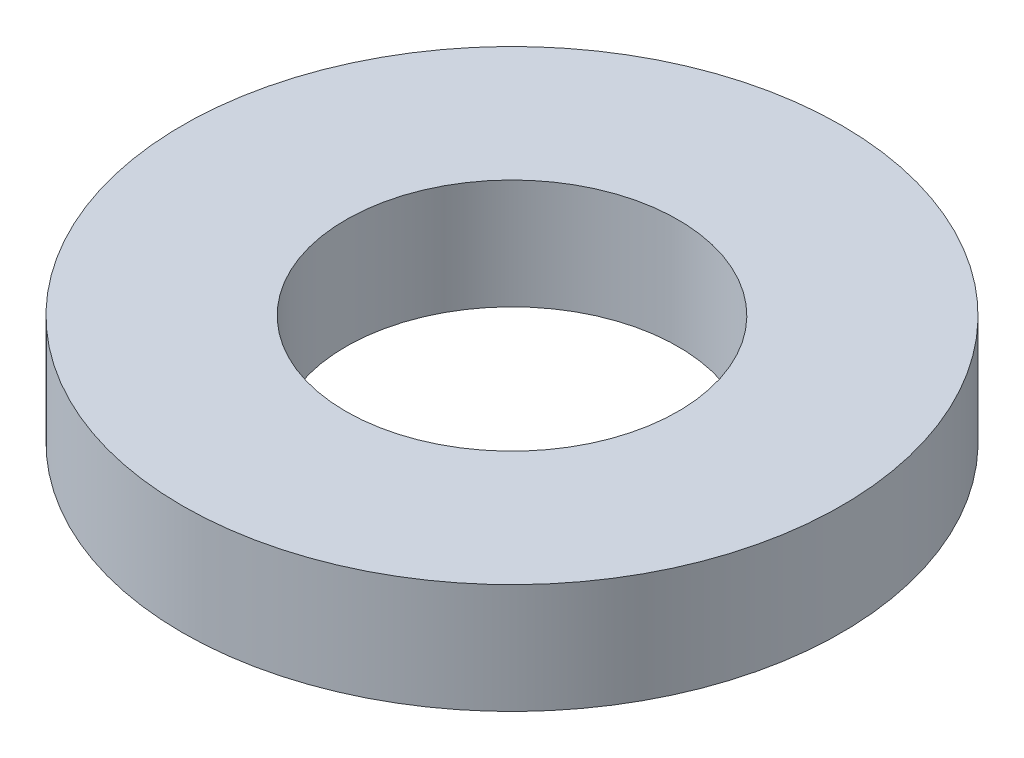
ISO-10303-21;
HEADER;
FILE_DESCRIPTION(('STEP AP214'),'2;1');
FILE_NAME('part.step','',(''),(''),'','','');
FILE_SCHEMA(('AUTOMOTIVE_DESIGN { 1 0 10303 214 1 1 1 1 }'));
ENDSEC;
DATA;
#1=APPLICATION_CONTEXT('core data for automotive mechanical design processes');
#2=APPLICATION_PROTOCOL_DEFINITION('international standard','automotive_design',2000,#1);
#3=PRODUCT_CONTEXT('',#1,'mechanical');
#4=PRODUCT('Part','Part','',(#3));
#5=PRODUCT_RELATED_PRODUCT_CATEGORY('part','',(#4));
#6=PRODUCT_DEFINITION_FORMATION('','',#4);
#7=PRODUCT_DEFINITION_CONTEXT('part definition',#1,'design');
#8=PRODUCT_DEFINITION('design','',#6,#7);
#9=PRODUCT_DEFINITION_SHAPE('','',#8);
#10=(LENGTH_UNIT() NAMED_UNIT(*) SI_UNIT(.MILLI.,.METRE.));
#11=(NAMED_UNIT(*) PLANE_ANGLE_UNIT() SI_UNIT($,.RADIAN.));
#12=(NAMED_UNIT(*) SI_UNIT($,.STERADIAN.) SOLID_ANGLE_UNIT());
#13=UNCERTAINTY_MEASURE_WITH_UNIT(LENGTH_MEASURE(1.E-05),#10,'distance_accuracy_value','');
#14=(GEOMETRIC_REPRESENTATION_CONTEXT(3) GLOBAL_UNCERTAINTY_ASSIGNED_CONTEXT((#13)) GLOBAL_UNIT_ASSIGNED_CONTEXT((#10,
#11,#12)) REPRESENTATION_CONTEXT('',''));
#15=CARTESIAN_POINT('',(0.,0.,0.));
#16=DIRECTION('',(0.,0.,1.));
#17=DIRECTION('',(1.,0.,0.));
#18=AXIS2_PLACEMENT_3D('',#15,#16,#17);
#19=CARTESIAN_POINT('',(0.,0.79375,0.));
#20=DIRECTION('',(0.,-1.,0.));
#21=DIRECTION('',(0.,0.,-1.));
#22=AXIS2_PLACEMENT_3D('',#19,#20,#21);
#23=CYLINDRICAL_SURFACE('',#22,2.38125);
#24=CARTESIAN_POINT('',(0.,0.79375,0.));
#25=DIRECTION('',(0.,1.,0.));
#26=DIRECTION('',(0.,0.,1.));
#27=AXIS2_PLACEMENT_3D('',#24,#25,#26);
#28=CIRCLE('',#27,2.38125);
#29=CARTESIAN_POINT('',(0.,0.79375,2.38125));
#30=VERTEX_POINT('',#29);
#31=EDGE_CURVE('E10',#30,#30,#28,.T.);
#32=ORIENTED_EDGE('',*,*,#31,.F.);
#33=EDGE_LOOP('',(#32));
#34=FACE_BOUND('',#33,.T.);
#35=CARTESIAN_POINT('',(0.,0.,0.));
#36=DIRECTION('',(0.,1.,0.));
#37=DIRECTION('',(0.,0.,1.));
#38=AXIS2_PLACEMENT_3D('',#35,#36,#37);
#39=CIRCLE('',#38,2.38125);
#40=CARTESIAN_POINT('',(0.,0.,2.38125));
#41=VERTEX_POINT('',#40);
#42=EDGE_CURVE('E38',#41,#41,#39,.T.);
#43=ORIENTED_EDGE('',*,*,#42,.T.);
#44=EDGE_LOOP('',(#43));
#45=FACE_BOUND('',#44,.T.);
#46=ADVANCED_FACE('F35',(#34,#45),#23,.T.);
#47=CARTESIAN_POINT('',(0.,0.79375,0.));
#48=DIRECTION('',(0.,1.,0.));
#49=DIRECTION('',(0.,0.,1.));
#50=AXIS2_PLACEMENT_3D('',#47,#48,#49);
#51=PLANE('',#50);
#52=CARTESIAN_POINT('',(0.,0.79375,0.));
#53=DIRECTION('',(0.,1.,0.));
#54=DIRECTION('',(0.,0.,1.));
#55=AXIS2_PLACEMENT_3D('',#52,#53,#54);
#56=CIRCLE('',#55,1.2);
#57=CARTESIAN_POINT('',(0.,0.79375,1.2));
#58=VERTEX_POINT('',#57);
#59=EDGE_CURVE('E49',#58,#58,#56,.T.);
#60=ORIENTED_EDGE('',*,*,#59,.F.);
#61=EDGE_LOOP('',(#60));
#62=FACE_BOUND('',#61,.T.);
#63=ORIENTED_EDGE('',*,*,#31,.T.);
#64=EDGE_LOOP('',(#63));
#65=FACE_BOUND('',#64,.T.);
#66=ADVANCED_FACE('F55',(#62,#65),#51,.T.);
#67=CARTESIAN_POINT('',(0.,0.,0.));
#68=DIRECTION('',(0.,1.,0.));
#69=DIRECTION('',(0.,0.,1.));
#70=AXIS2_PLACEMENT_3D('',#67,#68,#69);
#71=PLANE('',#70);
#72=CARTESIAN_POINT('',(0.,0.,0.));
#73=DIRECTION('',(0.,1.,0.));
#74=DIRECTION('',(0.,0.,1.));
#75=AXIS2_PLACEMENT_3D('',#72,#73,#74);
#76=CIRCLE('',#75,1.2);
#77=CARTESIAN_POINT('',(0.,0.,1.2));
#78=VERTEX_POINT('',#77);
#79=EDGE_CURVE('E45',#78,#78,#76,.T.);
#80=ORIENTED_EDGE('',*,*,#79,.T.);
#81=EDGE_LOOP('',(#80));
#82=FACE_BOUND('',#81,.T.);
#83=ORIENTED_EDGE('',*,*,#42,.F.);
#84=EDGE_LOOP('',(#83));
#85=FACE_BOUND('',#84,.T.);
#86=ADVANCED_FACE('F57',(#82,#85),#71,.F.);
#87=CARTESIAN_POINT('',(0.,0.79375,0.));
#88=DIRECTION('',(0.,1.,0.));
#89=DIRECTION('',(0.,0.,1.));
#90=AXIS2_PLACEMENT_3D('',#87,#88,#89);
#91=CYLINDRICAL_SURFACE('',#90,1.2);
#92=ORIENTED_EDGE('',*,*,#79,.F.);
#93=EDGE_LOOP('',(#92));
#94=FACE_BOUND('',#93,.T.);
#95=ORIENTED_EDGE('',*,*,#59,.T.);
#96=EDGE_LOOP('',(#95));
#97=FACE_BOUND('',#96,.T.);
#98=ADVANCED_FACE('F53',(#94,#97),#91,.F.);
#99=CLOSED_SHELL('',(#46,#66,#86,#98));
#100=MANIFOLD_SOLID_BREP('B2',#99);
#101=ADVANCED_BREP_SHAPE_REPRESENTATION('',(#18,#100),#14);
#102=SHAPE_DEFINITION_REPRESENTATION(#9,#101);
ENDSEC;
END-ISO-10303-21;
